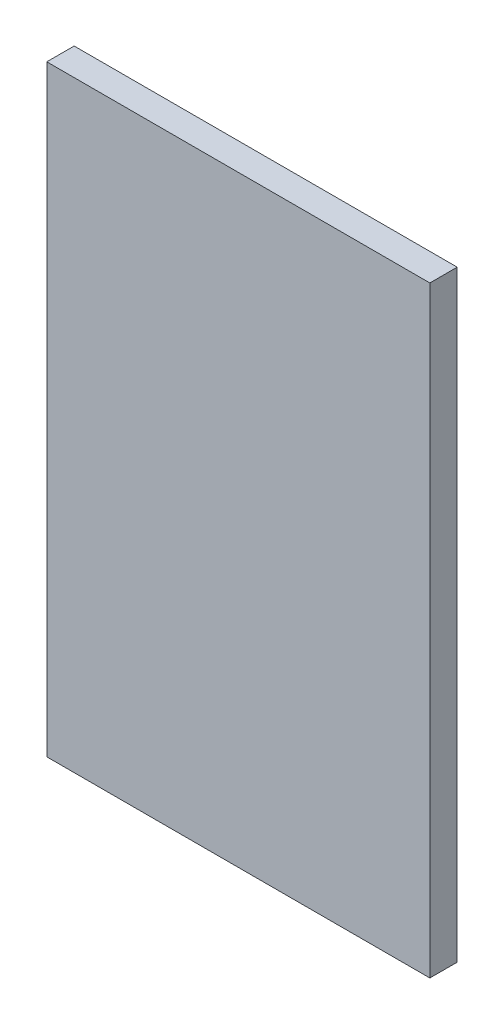
ISO-10303-21;
HEADER;
FILE_DESCRIPTION(('STEP AP214'),'2;1');
FILE_NAME('part.step','',(''),(''),'','','');
FILE_SCHEMA(('AUTOMOTIVE_DESIGN { 1 0 10303 214 1 1 1 1 }'));
ENDSEC;
DATA;
#1=APPLICATION_CONTEXT('core data for automotive mechanical design processes');
#2=APPLICATION_PROTOCOL_DEFINITION('international standard','automotive_design',2000,#1);
#3=PRODUCT_CONTEXT('',#1,'mechanical');
#4=PRODUCT('Part','Part','',(#3));
#5=PRODUCT_RELATED_PRODUCT_CATEGORY('part','',(#4));
#6=PRODUCT_DEFINITION_FORMATION('','',#4);
#7=PRODUCT_DEFINITION_CONTEXT('part definition',#1,'design');
#8=PRODUCT_DEFINITION('design','',#6,#7);
#9=PRODUCT_DEFINITION_SHAPE('','',#8);
#10=(LENGTH_UNIT() NAMED_UNIT(*) SI_UNIT(.MILLI.,.METRE.));
#11=(NAMED_UNIT(*) PLANE_ANGLE_UNIT() SI_UNIT($,.RADIAN.));
#12=(NAMED_UNIT(*) SI_UNIT($,.STERADIAN.) SOLID_ANGLE_UNIT());
#13=UNCERTAINTY_MEASURE_WITH_UNIT(LENGTH_MEASURE(1.E-05),#10,'distance_accuracy_value','');
#14=(GEOMETRIC_REPRESENTATION_CONTEXT(3) GLOBAL_UNCERTAINTY_ASSIGNED_CONTEXT((#13)) GLOBAL_UNIT_ASSIGNED_CONTEXT((#10,
#11,#12)) REPRESENTATION_CONTEXT('',''));
#15=CARTESIAN_POINT('',(0.,0.,0.));
#16=DIRECTION('',(0.,0.,1.));
#17=DIRECTION('',(1.,0.,0.));
#18=AXIS2_PLACEMENT_3D('',#15,#16,#17);
#19=CARTESIAN_POINT('',(-177.8,279.4,25.4));
#20=DIRECTION('',(1.,0.,0.));
#21=DIRECTION('',(0.,0.,-1.));
#22=AXIS2_PLACEMENT_3D('',#19,#20,#21);
#23=PLANE('',#22);
#24=DIRECTION('',(0.,-1.,0.));
#25=VECTOR('',#24,1.);
#26=CARTESIAN_POINT('',(-177.8,279.4,0.));
#27=LINE('',#26,#25);
#28=CARTESIAN_POINT('',(-177.8,279.4,0.));
#29=VERTEX_POINT('',#28);
#30=CARTESIAN_POINT('',(-177.8,-279.4,0.));
#31=VERTEX_POINT('',#30);
#32=EDGE_CURVE('E100',#29,#31,#27,.T.);
#33=ORIENTED_EDGE('',*,*,#32,.T.);
#34=DIRECTION('',(0.,0.,-1.));
#35=VECTOR('',#34,1.);
#36=CARTESIAN_POINT('',(-177.8,-279.4,25.4));
#37=LINE('',#36,#35);
#38=CARTESIAN_POINT('',(-177.8,-279.4,25.4));
#39=VERTEX_POINT('',#38);
#40=EDGE_CURVE('E11',#39,#31,#37,.T.);
#41=ORIENTED_EDGE('',*,*,#40,.F.);
#42=DIRECTION('',(0.,-1.,0.));
#43=VECTOR('',#42,1.);
#44=CARTESIAN_POINT('',(-177.8,279.4,25.4));
#45=LINE('',#44,#43);
#46=CARTESIAN_POINT('',(-177.8,279.4,25.4));
#47=VERTEX_POINT('',#46);
#48=EDGE_CURVE('E88',#47,#39,#45,.T.);
#49=ORIENTED_EDGE('',*,*,#48,.F.);
#50=DIRECTION('',(0.,0.,-1.));
#51=VECTOR('',#50,1.);
#52=CARTESIAN_POINT('',(-177.8,279.4,25.4));
#53=LINE('',#52,#51);
#54=EDGE_CURVE('E96',#47,#29,#53,.T.);
#55=ORIENTED_EDGE('',*,*,#54,.T.);
#56=EDGE_LOOP('',(#33,#41,#49,#55));
#57=FACE_BOUND('',#56,.T.);
#58=ADVANCED_FACE('F37',(#57),#23,.F.);
#59=CARTESIAN_POINT('',(-177.8,-279.4,25.4));
#60=DIRECTION('',(0.,1.,0.));
#61=DIRECTION('',(0.,0.,1.));
#62=AXIS2_PLACEMENT_3D('',#59,#60,#61);
#63=PLANE('',#62);
#64=DIRECTION('',(1.,0.,0.));
#65=VECTOR('',#64,1.);
#66=CARTESIAN_POINT('',(-177.8,-279.4,0.));
#67=LINE('',#66,#65);
#68=CARTESIAN_POINT('',(177.8,-279.4,0.));
#69=VERTEX_POINT('',#68);
#70=EDGE_CURVE('E92',#31,#69,#67,.T.);
#71=ORIENTED_EDGE('',*,*,#70,.T.);
#72=DIRECTION('',(0.,0.,-1.));
#73=VECTOR('',#72,1.);
#74=CARTESIAN_POINT('',(177.8,-279.4,25.4));
#75=LINE('',#74,#73);
#76=CARTESIAN_POINT('',(177.8,-279.4,25.4));
#77=VERTEX_POINT('',#76);
#78=EDGE_CURVE('E45',#77,#69,#75,.T.);
#79=ORIENTED_EDGE('',*,*,#78,.F.);
#80=DIRECTION('',(1.,0.,0.));
#81=VECTOR('',#80,1.);
#82=CARTESIAN_POINT('',(-177.8,-279.4,25.4));
#83=LINE('',#82,#81);
#84=EDGE_CURVE('E83',#39,#77,#83,.T.);
#85=ORIENTED_EDGE('',*,*,#84,.F.);
#86=ORIENTED_EDGE('',*,*,#40,.T.);
#87=EDGE_LOOP('',(#71,#79,#85,#86));
#88=FACE_BOUND('',#87,.T.);
#89=ADVANCED_FACE('F91',(#88),#63,.F.);
#90=CARTESIAN_POINT('',(177.8,279.4,25.4));
#91=DIRECTION('',(-1.,0.,0.));
#92=DIRECTION('',(0.,0.,1.));
#93=AXIS2_PLACEMENT_3D('',#90,#91,#92);
#94=PLANE('',#93);
#95=DIRECTION('',(0.,1.,0.));
#96=VECTOR('',#95,1.);
#97=CARTESIAN_POINT('',(177.8,279.4,0.));
#98=LINE('',#97,#96);
#99=CARTESIAN_POINT('',(177.8,279.4,0.));
#100=VERTEX_POINT('',#99);
#101=EDGE_CURVE('E70',#69,#100,#98,.T.);
#102=ORIENTED_EDGE('',*,*,#101,.T.);
#103=DIRECTION('',(0.,0.,-1.));
#104=VECTOR('',#103,1.);
#105=CARTESIAN_POINT('',(177.8,279.4,25.4));
#106=LINE('',#105,#104);
#107=CARTESIAN_POINT('',(177.8,279.4,25.4));
#108=VERTEX_POINT('',#107);
#109=EDGE_CURVE('E93',#108,#100,#106,.T.);
#110=ORIENTED_EDGE('',*,*,#109,.F.);
#111=DIRECTION('',(0.,1.,0.));
#112=VECTOR('',#111,1.);
#113=CARTESIAN_POINT('',(177.8,279.4,25.4));
#114=LINE('',#113,#112);
#115=EDGE_CURVE('E86',#77,#108,#114,.T.);
#116=ORIENTED_EDGE('',*,*,#115,.F.);
#117=ORIENTED_EDGE('',*,*,#78,.T.);
#118=EDGE_LOOP('',(#102,#110,#116,#117));
#119=FACE_BOUND('',#118,.T.);
#120=ADVANCED_FACE('F94',(#119),#94,.F.);
#121=CARTESIAN_POINT('',(-177.8,279.4,25.4));
#122=DIRECTION('',(0.,-1.,0.));
#123=DIRECTION('',(0.,0.,-1.));
#124=AXIS2_PLACEMENT_3D('',#121,#122,#123);
#125=PLANE('',#124);
#126=DIRECTION('',(-1.,0.,0.));
#127=VECTOR('',#126,1.);
#128=CARTESIAN_POINT('',(-177.8,279.4,0.));
#129=LINE('',#128,#127);
#130=EDGE_CURVE('E76',#100,#29,#129,.T.);
#131=ORIENTED_EDGE('',*,*,#130,.T.);
#132=ORIENTED_EDGE('',*,*,#54,.F.);
#133=DIRECTION('',(-1.,0.,0.));
#134=VECTOR('',#133,1.);
#135=CARTESIAN_POINT('',(-177.8,279.4,25.4));
#136=LINE('',#135,#134);
#137=EDGE_CURVE('E53',#108,#47,#136,.T.);
#138=ORIENTED_EDGE('',*,*,#137,.F.);
#139=ORIENTED_EDGE('',*,*,#109,.T.);
#140=EDGE_LOOP('',(#131,#132,#138,#139));
#141=FACE_BOUND('',#140,.T.);
#142=ADVANCED_FACE('F107',(#141),#125,.F.);
#143=CARTESIAN_POINT('',(0.,0.,25.4));
#144=DIRECTION('',(0.,0.,1.));
#145=DIRECTION('',(1.,0.,0.));
#146=AXIS2_PLACEMENT_3D('',#143,#144,#145);
#147=PLANE('',#146);
#148=ORIENTED_EDGE('',*,*,#48,.T.);
#149=ORIENTED_EDGE('',*,*,#84,.T.);
#150=ORIENTED_EDGE('',*,*,#115,.T.);
#151=ORIENTED_EDGE('',*,*,#137,.T.);
#152=EDGE_LOOP('',(#148,#149,#150,#151));
#153=FACE_BOUND('',#152,.T.);
#154=ADVANCED_FACE('F84',(#153),#147,.T.);
#155=CARTESIAN_POINT('',(0.,0.,0.));
#156=DIRECTION('',(0.,0.,1.));
#157=DIRECTION('',(1.,0.,0.));
#158=AXIS2_PLACEMENT_3D('',#155,#156,#157);
#159=PLANE('',#158);
#160=ORIENTED_EDGE('',*,*,#32,.F.);
#161=ORIENTED_EDGE('',*,*,#130,.F.);
#162=ORIENTED_EDGE('',*,*,#101,.F.);
#163=ORIENTED_EDGE('',*,*,#70,.F.);
#164=EDGE_LOOP('',(#160,#161,#162,#163));
#165=FACE_BOUND('',#164,.T.);
#166=ADVANCED_FACE('F110',(#165),#159,.F.);
#167=CLOSED_SHELL('',(#58,#89,#120,#142,#154,#166));
#168=MANIFOLD_SOLID_BREP('B2',#167);
#169=ADVANCED_BREP_SHAPE_REPRESENTATION('',(#18,#168),#14);
#170=SHAPE_DEFINITION_REPRESENTATION(#9,#169);
ENDSEC;
END-ISO-10303-21;
